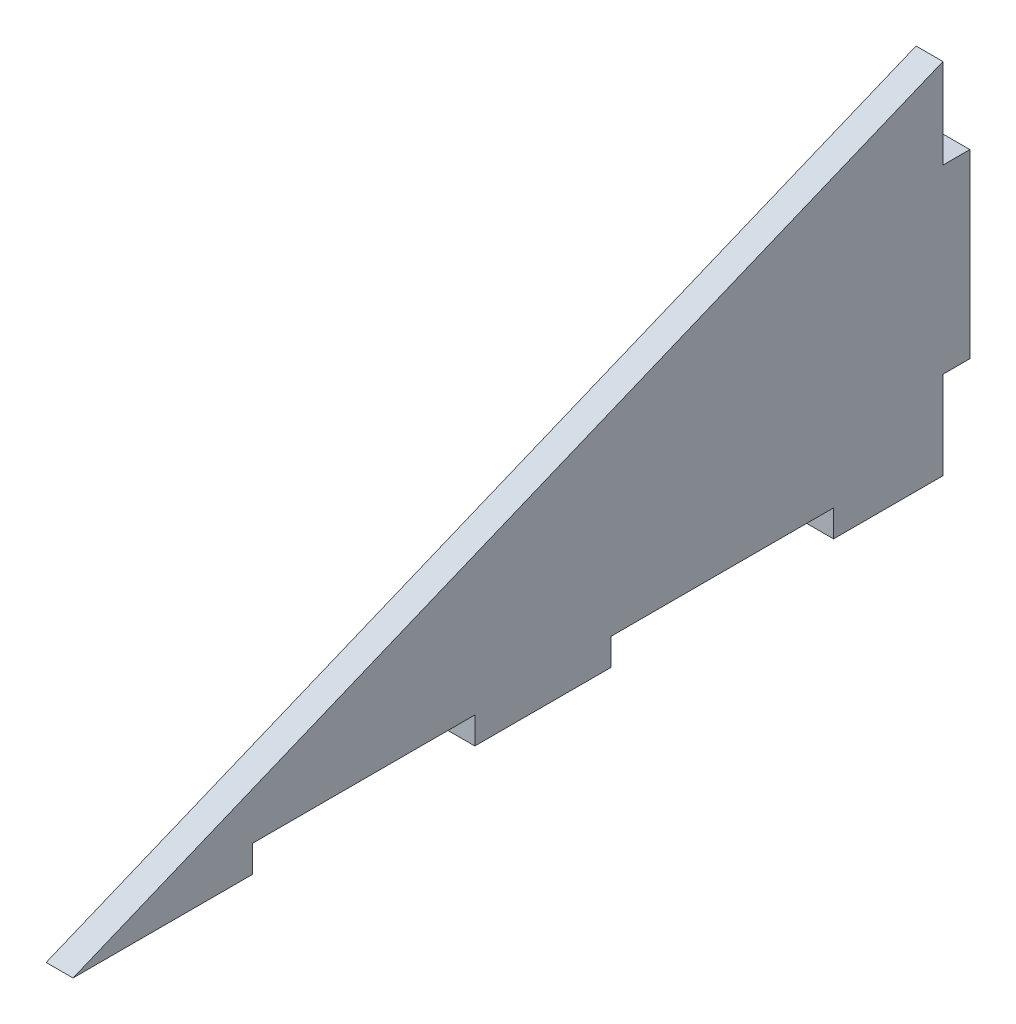
ISO-10303-21;
HEADER;
FILE_DESCRIPTION(('STEP AP214'),'2;1');
FILE_NAME('part.step','',(''),(''),'','','');
FILE_SCHEMA(('AUTOMOTIVE_DESIGN { 1 0 10303 214 1 1 1 1 }'));
ENDSEC;
DATA;
#1=APPLICATION_CONTEXT('core data for automotive mechanical design processes');
#2=APPLICATION_PROTOCOL_DEFINITION('international standard','automotive_design',2000,#1);
#3=PRODUCT_CONTEXT('',#1,'mechanical');
#4=PRODUCT('Part','Part','',(#3));
#5=PRODUCT_RELATED_PRODUCT_CATEGORY('part','',(#4));
#6=PRODUCT_DEFINITION_FORMATION('','',#4);
#7=PRODUCT_DEFINITION_CONTEXT('part definition',#1,'design');
#8=PRODUCT_DEFINITION('design','',#6,#7);
#9=PRODUCT_DEFINITION_SHAPE('','',#8);
#10=(LENGTH_UNIT() NAMED_UNIT(*) SI_UNIT(.MILLI.,.METRE.));
#11=(NAMED_UNIT(*) PLANE_ANGLE_UNIT() SI_UNIT($,.RADIAN.));
#12=(NAMED_UNIT(*) SI_UNIT($,.STERADIAN.) SOLID_ANGLE_UNIT());
#13=UNCERTAINTY_MEASURE_WITH_UNIT(LENGTH_MEASURE(1.E-05),#10,'distance_accuracy_value','');
#14=(GEOMETRIC_REPRESENTATION_CONTEXT(3) GLOBAL_UNCERTAINTY_ASSIGNED_CONTEXT((#13)) GLOBAL_UNIT_ASSIGNED_CONTEXT((#10,
#11,#12)) REPRESENTATION_CONTEXT('',''));
#15=CARTESIAN_POINT('',(0.,0.,0.));
#16=DIRECTION('',(0.,0.,1.));
#17=DIRECTION('',(1.,0.,0.));
#18=AXIS2_PLACEMENT_3D('',#15,#16,#17);
#19=CARTESIAN_POINT('',(3.,0.,40.));
#20=DIRECTION('',(0.,0.,1.));
#21=DIRECTION('',(1.,0.,0.));
#22=AXIS2_PLACEMENT_3D('',#19,#20,#21);
#23=PLANE('',#22);
#24=DIRECTION('',(0.,1.,0.));
#25=VECTOR('',#24,1.);
#26=CARTESIAN_POINT('',(0.,0.,40.));
#27=LINE('',#26,#25);
#28=CARTESIAN_POINT('',(0.,0.,40.));
#29=VERTEX_POINT('',#28);
#30=CARTESIAN_POINT('',(0.,2.99999999999999,40.));
#31=VERTEX_POINT('',#30);
#32=EDGE_CURVE('E178',#29,#31,#27,.T.);
#33=ORIENTED_EDGE('',*,*,#32,.T.);
#34=DIRECTION('',(-1.,0.,0.));
#35=VECTOR('',#34,1.);
#36=CARTESIAN_POINT('',(3.,2.99999999999999,40.));
#37=LINE('',#36,#35);
#38=CARTESIAN_POINT('',(3.,2.99999999999999,40.));
#39=VERTEX_POINT('',#38);
#40=EDGE_CURVE('E11',#39,#31,#37,.T.);
#41=ORIENTED_EDGE('',*,*,#40,.F.);
#42=DIRECTION('',(0.,1.,0.));
#43=VECTOR('',#42,1.);
#44=CARTESIAN_POINT('',(3.,0.,40.));
#45=LINE('',#44,#43);
#46=CARTESIAN_POINT('',(3.,0.,40.));
#47=VERTEX_POINT('',#46);
#48=EDGE_CURVE('E254',#47,#39,#45,.T.);
#49=ORIENTED_EDGE('',*,*,#48,.F.);
#50=DIRECTION('',(-1.,0.,0.));
#51=VECTOR('',#50,1.);
#52=CARTESIAN_POINT('',(3.,0.,40.));
#53=LINE('',#52,#51);
#54=EDGE_CURVE('E52',#47,#29,#53,.T.);
#55=ORIENTED_EDGE('',*,*,#54,.T.);
#56=EDGE_LOOP('',(#33,#41,#49,#55));
#57=FACE_BOUND('',#56,.T.);
#58=ADVANCED_FACE('F36',(#57),#23,.F.);
#59=CARTESIAN_POINT('',(3.,2.99999999999999,0.));
#60=DIRECTION('',(0.,1.,0.));
#61=DIRECTION('',(0.,0.,1.));
#62=AXIS2_PLACEMENT_3D('',#59,#60,#61);
#63=PLANE('',#62);
#64=DIRECTION('',(0.,0.,-1.));
#65=VECTOR('',#64,1.);
#66=CARTESIAN_POINT('',(0.,2.99999999999999,0.));
#67=LINE('',#66,#65);
#68=CARTESIAN_POINT('',(0.,2.99999999999999,15.2));
#69=VERTEX_POINT('',#68);
#70=EDGE_CURVE('E180',#31,#69,#67,.T.);
#71=ORIENTED_EDGE('',*,*,#70,.T.);
#72=DIRECTION('',(-1.,0.,0.));
#73=VECTOR('',#72,1.);
#74=CARTESIAN_POINT('',(3.,2.99999999999999,15.2));
#75=LINE('',#74,#73);
#76=CARTESIAN_POINT('',(3.,2.99999999999999,15.2));
#77=VERTEX_POINT('',#76);
#78=EDGE_CURVE('E44',#77,#69,#75,.T.);
#79=ORIENTED_EDGE('',*,*,#78,.F.);
#80=DIRECTION('',(0.,0.,-1.));
#81=VECTOR('',#80,1.);
#82=CARTESIAN_POINT('',(3.,2.99999999999999,0.));
#83=LINE('',#82,#81);
#84=EDGE_CURVE('E111',#39,#77,#83,.T.);
#85=ORIENTED_EDGE('',*,*,#84,.F.);
#86=ORIENTED_EDGE('',*,*,#40,.T.);
#87=EDGE_LOOP('',(#71,#79,#85,#86));
#88=FACE_BOUND('',#87,.T.);
#89=ADVANCED_FACE('F240',(#88),#63,.F.);
#90=CARTESIAN_POINT('',(3.,0.,15.2));
#91=DIRECTION('',(0.,0.,1.));
#92=DIRECTION('',(1.,0.,0.));
#93=AXIS2_PLACEMENT_3D('',#90,#91,#92);
#94=PLANE('',#93);
#95=DIRECTION('',(0.,1.,0.));
#96=VECTOR('',#95,1.);
#97=CARTESIAN_POINT('',(0.,0.,15.2));
#98=LINE('',#97,#96);
#99=CARTESIAN_POINT('',(0.,0.,15.2));
#100=VERTEX_POINT('',#99);
#101=EDGE_CURVE('E183',#100,#69,#98,.T.);
#102=ORIENTED_EDGE('',*,*,#101,.F.);
#103=DIRECTION('',(-1.,0.,0.));
#104=VECTOR('',#103,1.);
#105=CARTESIAN_POINT('',(3.,0.,15.2));
#106=LINE('',#105,#104);
#107=CARTESIAN_POINT('',(3.,0.,15.2));
#108=VERTEX_POINT('',#107);
#109=EDGE_CURVE('E233',#108,#100,#106,.T.);
#110=ORIENTED_EDGE('',*,*,#109,.F.);
#111=DIRECTION('',(0.,1.,0.));
#112=VECTOR('',#111,1.);
#113=CARTESIAN_POINT('',(3.,0.,15.2));
#114=LINE('',#113,#112);
#115=EDGE_CURVE('E239',#108,#77,#114,.T.);
#116=ORIENTED_EDGE('',*,*,#115,.T.);
#117=ORIENTED_EDGE('',*,*,#78,.T.);
#118=EDGE_LOOP('',(#102,#110,#116,#117));
#119=FACE_BOUND('',#118,.T.);
#120=ADVANCED_FACE('F237',(#119),#94,.T.);
#121=CARTESIAN_POINT('',(3.,0.,0.));
#122=DIRECTION('',(0.,-1.,0.));
#123=DIRECTION('',(0.,0.,-1.));
#124=AXIS2_PLACEMENT_3D('',#121,#122,#123);
#125=PLANE('',#124);
#126=DIRECTION('',(0.,0.,1.));
#127=VECTOR('',#126,1.);
#128=CARTESIAN_POINT('',(0.,0.,0.));
#129=LINE('',#128,#127);
#130=CARTESIAN_POINT('',(0.,0.,3.));
#131=VERTEX_POINT('',#130);
#132=EDGE_CURVE('E186',#131,#100,#129,.T.);
#133=ORIENTED_EDGE('',*,*,#132,.F.);
#134=DIRECTION('',(-1.,0.,0.));
#135=VECTOR('',#134,1.);
#136=CARTESIAN_POINT('',(3.,0.,3.));
#137=LINE('',#136,#135);
#138=CARTESIAN_POINT('',(3.,0.,3.));
#139=VERTEX_POINT('',#138);
#140=EDGE_CURVE('E231',#139,#131,#137,.T.);
#141=ORIENTED_EDGE('',*,*,#140,.F.);
#142=DIRECTION('',(0.,0.,1.));
#143=VECTOR('',#142,1.);
#144=CARTESIAN_POINT('',(3.,0.,0.));
#145=LINE('',#144,#143);
#146=EDGE_CURVE('E175',#139,#108,#145,.T.);
#147=ORIENTED_EDGE('',*,*,#146,.T.);
#148=ORIENTED_EDGE('',*,*,#109,.T.);
#149=EDGE_LOOP('',(#133,#141,#147,#148));
#150=FACE_BOUND('',#149,.T.);
#151=ADVANCED_FACE('F247',(#150),#125,.T.);
#152=CARTESIAN_POINT('',(3.,0.,3.));
#153=DIRECTION('',(0.,0.,-1.));
#154=DIRECTION('',(0.,1.,0.));
#155=AXIS2_PLACEMENT_3D('',#152,#153,#154);
#156=PLANE('',#155);
#157=DIRECTION('',(0.,-1.,0.));
#158=VECTOR('',#157,1.);
#159=CARTESIAN_POINT('',(0.,0.,3.));
#160=LINE('',#159,#158);
#161=CARTESIAN_POINT('',(0.,9.8,3.));
#162=VERTEX_POINT('',#161);
#163=EDGE_CURVE('E189',#162,#131,#160,.T.);
#164=ORIENTED_EDGE('',*,*,#163,.F.);
#165=DIRECTION('',(-1.,0.,0.));
#166=VECTOR('',#165,1.);
#167=CARTESIAN_POINT('',(3.,9.8,3.));
#168=LINE('',#167,#166);
#169=CARTESIAN_POINT('',(3.,9.8,3.));
#170=VERTEX_POINT('',#169);
#171=EDGE_CURVE('E229',#170,#162,#168,.T.);
#172=ORIENTED_EDGE('',*,*,#171,.F.);
#173=DIRECTION('',(0.,-1.,0.));
#174=VECTOR('',#173,1.);
#175=CARTESIAN_POINT('',(3.,0.,3.));
#176=LINE('',#175,#174);
#177=EDGE_CURVE('E253',#170,#139,#176,.T.);
#178=ORIENTED_EDGE('',*,*,#177,.T.);
#179=ORIENTED_EDGE('',*,*,#140,.T.);
#180=EDGE_LOOP('',(#164,#172,#178,#179));
#181=FACE_BOUND('',#180,.T.);
#182=ADVANCED_FACE('F298',(#181),#156,.T.);
#183=CARTESIAN_POINT('',(3.,9.8,0.));
#184=DIRECTION('',(0.,-1.,0.));
#185=DIRECTION('',(0.,0.,-1.));
#186=AXIS2_PLACEMENT_3D('',#183,#184,#185);
#187=PLANE('',#186);
#188=DIRECTION('',(0.,0.,1.));
#189=VECTOR('',#188,1.);
#190=CARTESIAN_POINT('',(0.,9.8,0.));
#191=LINE('',#190,#189);
#192=CARTESIAN_POINT('',(0.,9.8,0.));
#193=VERTEX_POINT('',#192);
#194=EDGE_CURVE('E194',#193,#162,#191,.T.);
#195=ORIENTED_EDGE('',*,*,#194,.F.);
#196=DIRECTION('',(-1.,0.,0.));
#197=VECTOR('',#196,1.);
#198=CARTESIAN_POINT('',(3.,9.8,0.));
#199=LINE('',#198,#197);
#200=CARTESIAN_POINT('',(3.,9.8,0.));
#201=VERTEX_POINT('',#200);
#202=EDGE_CURVE('E227',#201,#193,#199,.T.);
#203=ORIENTED_EDGE('',*,*,#202,.F.);
#204=DIRECTION('',(0.,0.,1.));
#205=VECTOR('',#204,1.);
#206=CARTESIAN_POINT('',(3.,9.8,0.));
#207=LINE('',#206,#205);
#208=EDGE_CURVE('E259',#201,#170,#207,.T.);
#209=ORIENTED_EDGE('',*,*,#208,.T.);
#210=ORIENTED_EDGE('',*,*,#171,.T.);
#211=EDGE_LOOP('',(#195,#203,#209,#210));
#212=FACE_BOUND('',#211,.T.);
#213=ADVANCED_FACE('F312',(#212),#187,.T.);
#214=CARTESIAN_POINT('',(3.,0.,0.));
#215=DIRECTION('',(0.,0.,-1.));
#216=DIRECTION('',(-1.,0.,0.));
#217=AXIS2_PLACEMENT_3D('',#214,#215,#216);
#218=PLANE('',#217);
#219=DIRECTION('',(0.,-1.,0.));
#220=VECTOR('',#219,1.);
#221=CARTESIAN_POINT('',(0.,0.,0.));
#222=LINE('',#221,#220);
#223=CARTESIAN_POINT('',(0.,30.,0.));
#224=VERTEX_POINT('',#223);
#225=EDGE_CURVE('E197',#224,#193,#222,.T.);
#226=ORIENTED_EDGE('',*,*,#225,.F.);
#227=DIRECTION('',(-1.,0.,0.));
#228=VECTOR('',#227,1.);
#229=CARTESIAN_POINT('',(3.,30.,0.));
#230=LINE('',#229,#228);
#231=CARTESIAN_POINT('',(3.,30.,0.));
#232=VERTEX_POINT('',#231);
#233=EDGE_CURVE('E225',#232,#224,#230,.T.);
#234=ORIENTED_EDGE('',*,*,#233,.F.);
#235=DIRECTION('',(0.,-1.,0.));
#236=VECTOR('',#235,1.);
#237=CARTESIAN_POINT('',(3.,0.,0.));
#238=LINE('',#237,#236);
#239=EDGE_CURVE('E262',#232,#201,#238,.T.);
#240=ORIENTED_EDGE('',*,*,#239,.T.);
#241=ORIENTED_EDGE('',*,*,#202,.T.);
#242=EDGE_LOOP('',(#226,#234,#240,#241));
#243=FACE_BOUND('',#242,.T.);
#244=ADVANCED_FACE('F316',(#243),#218,.T.);
#245=CARTESIAN_POINT('',(3.,30.,0.));
#246=DIRECTION('',(0.,1.,0.));
#247=DIRECTION('',(0.,0.,1.));
#248=AXIS2_PLACEMENT_3D('',#245,#246,#247);
#249=PLANE('',#248);
#250=DIRECTION('',(0.,0.,-1.));
#251=VECTOR('',#250,1.);
#252=CARTESIAN_POINT('',(0.,30.,0.));
#253=LINE('',#252,#251);
#254=CARTESIAN_POINT('',(0.,30.,2.99999999999998));
#255=VERTEX_POINT('',#254);
#256=EDGE_CURVE('E200',#255,#224,#253,.T.);
#257=ORIENTED_EDGE('',*,*,#256,.F.);
#258=DIRECTION('',(-1.,0.,0.));
#259=VECTOR('',#258,1.);
#260=CARTESIAN_POINT('',(3.,30.,2.99999999999998));
#261=LINE('',#260,#259);
#262=CARTESIAN_POINT('',(3.,30.,2.99999999999998));
#263=VERTEX_POINT('',#262);
#264=EDGE_CURVE('E223',#263,#255,#261,.T.);
#265=ORIENTED_EDGE('',*,*,#264,.F.);
#266=DIRECTION('',(0.,0.,-1.));
#267=VECTOR('',#266,1.);
#268=CARTESIAN_POINT('',(3.,30.,0.));
#269=LINE('',#268,#267);
#270=EDGE_CURVE('E265',#263,#232,#269,.T.);
#271=ORIENTED_EDGE('',*,*,#270,.T.);
#272=ORIENTED_EDGE('',*,*,#233,.T.);
#273=EDGE_LOOP('',(#257,#265,#271,#272));
#274=FACE_BOUND('',#273,.T.);
#275=ADVANCED_FACE('F320',(#274),#249,.T.);
#276=CARTESIAN_POINT('',(3.,0.,2.99999999999997));
#277=DIRECTION('',(0.,0.,-1.));
#278=DIRECTION('',(0.,1.,0.));
#279=AXIS2_PLACEMENT_3D('',#276,#277,#278);
#280=PLANE('',#279);
#281=DIRECTION('',(0.,-1.,0.));
#282=VECTOR('',#281,1.);
#283=CARTESIAN_POINT('',(0.,0.,2.99999999999997));
#284=LINE('',#283,#282);
#285=CARTESIAN_POINT('',(0.,40.,2.99999999999998));
#286=VERTEX_POINT('',#285);
#287=EDGE_CURVE('E203',#286,#255,#284,.T.);
#288=ORIENTED_EDGE('',*,*,#287,.F.);
#289=DIRECTION('',(-1.,0.,0.));
#290=VECTOR('',#289,1.);
#291=CARTESIAN_POINT('',(3.,40.,2.99999999999998));
#292=LINE('',#291,#290);
#293=CARTESIAN_POINT('',(3.,40.,2.99999999999998));
#294=VERTEX_POINT('',#293);
#295=EDGE_CURVE('E221',#294,#286,#292,.T.);
#296=ORIENTED_EDGE('',*,*,#295,.F.);
#297=DIRECTION('',(0.,-1.,0.));
#298=VECTOR('',#297,1.);
#299=CARTESIAN_POINT('',(3.,0.,2.99999999999997));
#300=LINE('',#299,#298);
#301=EDGE_CURVE('E268',#294,#263,#300,.T.);
#302=ORIENTED_EDGE('',*,*,#301,.T.);
#303=ORIENTED_EDGE('',*,*,#264,.T.);
#304=EDGE_LOOP('',(#288,#296,#302,#303));
#305=FACE_BOUND('',#304,.T.);
#306=ADVANCED_FACE('F324',(#305),#280,.T.);
#307=CARTESIAN_POINT('',(3.,35.2438913616132,14.5335634480879));
#308=DIRECTION('',(0.,0.924480592289054,0.38122911022229));
#309=DIRECTION('',(0.,-0.38122911022229,0.924480592289055));
#310=AXIS2_PLACEMENT_3D('',#307,#308,#309);
#311=PLANE('',#310);
#312=DIRECTION('',(0.,0.38122911022229,-0.924480592289055));
#313=VECTOR('',#312,1.);
#314=CARTESIAN_POINT('',(0.,35.2438913616132,14.5335634480879));
#315=LINE('',#314,#313);
#316=CARTESIAN_POINT('',(0.,0.,100.));
#317=VERTEX_POINT('',#316);
#318=EDGE_CURVE('E206',#317,#286,#315,.T.);
#319=ORIENTED_EDGE('',*,*,#318,.F.);
#320=DIRECTION('',(-1.,0.,0.));
#321=VECTOR('',#320,1.);
#322=CARTESIAN_POINT('',(3.,0.,100.));
#323=LINE('',#322,#321);
#324=CARTESIAN_POINT('',(3.,0.,100.));
#325=VERTEX_POINT('',#324);
#326=EDGE_CURVE('E219',#325,#317,#323,.T.);
#327=ORIENTED_EDGE('',*,*,#326,.F.);
#328=DIRECTION('',(0.,0.38122911022229,-0.924480592289055));
#329=VECTOR('',#328,1.);
#330=CARTESIAN_POINT('',(3.,35.2438913616132,14.5335634480879));
#331=LINE('',#330,#329);
#332=EDGE_CURVE('E271',#325,#294,#331,.T.);
#333=ORIENTED_EDGE('',*,*,#332,.T.);
#334=ORIENTED_EDGE('',*,*,#295,.T.);
#335=EDGE_LOOP('',(#319,#327,#333,#334));
#336=FACE_BOUND('',#335,.T.);
#337=ADVANCED_FACE('F282',(#336),#311,.T.);
#338=CARTESIAN_POINT('',(0.,0.,80.));
#339=VERTEX_POINT('',#338);
#340=EDGE_CURVE('E191',#339,#317,#129,.T.);
#341=ORIENTED_EDGE('',*,*,#340,.F.);
#342=DIRECTION('',(-1.,0.,0.));
#343=VECTOR('',#342,1.);
#344=CARTESIAN_POINT('',(3.,0.,80.));
#345=LINE('',#344,#343);
#346=CARTESIAN_POINT('',(3.,0.,80.));
#347=VERTEX_POINT('',#346);
#348=EDGE_CURVE('E217',#347,#339,#345,.T.);
#349=ORIENTED_EDGE('',*,*,#348,.F.);
#350=EDGE_CURVE('E174',#347,#325,#145,.T.);
#351=ORIENTED_EDGE('',*,*,#350,.T.);
#352=ORIENTED_EDGE('',*,*,#326,.T.);
#353=EDGE_LOOP('',(#341,#349,#351,#352));
#354=FACE_BOUND('',#353,.T.);
#355=ADVANCED_FACE('F276',(#354),#125,.T.);
#356=CARTESIAN_POINT('',(3.,0.,80.));
#357=DIRECTION('',(0.,0.,1.));
#358=DIRECTION('',(1.,0.,0.));
#359=AXIS2_PLACEMENT_3D('',#356,#357,#358);
#360=PLANE('',#359);
#361=DIRECTION('',(0.,1.,0.));
#362=VECTOR('',#361,1.);
#363=CARTESIAN_POINT('',(0.,0.,80.));
#364=LINE('',#363,#362);
#365=CARTESIAN_POINT('',(0.,2.99999999999999,80.));
#366=VERTEX_POINT('',#365);
#367=EDGE_CURVE('E209',#339,#366,#364,.T.);
#368=ORIENTED_EDGE('',*,*,#367,.T.);
#369=DIRECTION('',(-1.,0.,0.));
#370=VECTOR('',#369,1.);
#371=CARTESIAN_POINT('',(3.,2.99999999999999,80.));
#372=LINE('',#371,#370);
#373=CARTESIAN_POINT('',(3.,2.99999999999999,80.));
#374=VERTEX_POINT('',#373);
#375=EDGE_CURVE('E168',#374,#366,#372,.T.);
#376=ORIENTED_EDGE('',*,*,#375,.F.);
#377=DIRECTION('',(0.,1.,0.));
#378=VECTOR('',#377,1.);
#379=CARTESIAN_POINT('',(3.,0.,80.));
#380=LINE('',#379,#378);
#381=EDGE_CURVE('E156',#347,#374,#380,.T.);
#382=ORIENTED_EDGE('',*,*,#381,.F.);
#383=ORIENTED_EDGE('',*,*,#348,.T.);
#384=EDGE_LOOP('',(#368,#376,#382,#383));
#385=FACE_BOUND('',#384,.T.);
#386=ADVANCED_FACE('F300',(#385),#360,.F.);
#387=CARTESIAN_POINT('',(3.,2.99999999999999,0.));
#388=DIRECTION('',(0.,1.,0.));
#389=DIRECTION('',(0.,0.,1.));
#390=AXIS2_PLACEMENT_3D('',#387,#388,#389);
#391=PLANE('',#390);
#392=DIRECTION('',(0.,0.,-1.));
#393=VECTOR('',#392,1.);
#394=CARTESIAN_POINT('',(0.,2.99999999999999,0.));
#395=LINE('',#394,#393);
#396=CARTESIAN_POINT('',(0.,2.99999999999999,55.2));
#397=VERTEX_POINT('',#396);
#398=EDGE_CURVE('E165',#366,#397,#395,.T.);
#399=ORIENTED_EDGE('',*,*,#398,.T.);
#400=DIRECTION('',(-1.,0.,0.));
#401=VECTOR('',#400,1.);
#402=CARTESIAN_POINT('',(3.,2.99999999999999,55.2));
#403=LINE('',#402,#401);
#404=CARTESIAN_POINT('',(3.,2.99999999999999,55.2));
#405=VERTEX_POINT('',#404);
#406=EDGE_CURVE('E162',#405,#397,#403,.T.);
#407=ORIENTED_EDGE('',*,*,#406,.F.);
#408=DIRECTION('',(0.,0.,-1.));
#409=VECTOR('',#408,1.);
#410=CARTESIAN_POINT('',(3.,2.99999999999999,0.));
#411=LINE('',#410,#409);
#412=EDGE_CURVE('E148',#374,#405,#411,.T.);
#413=ORIENTED_EDGE('',*,*,#412,.F.);
#414=ORIENTED_EDGE('',*,*,#375,.T.);
#415=EDGE_LOOP('',(#399,#407,#413,#414));
#416=FACE_BOUND('',#415,.T.);
#417=ADVANCED_FACE('F163',(#416),#391,.F.);
#418=CARTESIAN_POINT('',(3.,0.,55.2));
#419=DIRECTION('',(0.,0.,1.));
#420=DIRECTION('',(1.,0.,0.));
#421=AXIS2_PLACEMENT_3D('',#418,#419,#420);
#422=PLANE('',#421);
#423=DIRECTION('',(0.,1.,0.));
#424=VECTOR('',#423,1.);
#425=CARTESIAN_POINT('',(0.,0.,55.2));
#426=LINE('',#425,#424);
#427=CARTESIAN_POINT('',(0.,0.,55.2));
#428=VERTEX_POINT('',#427);
#429=EDGE_CURVE('E212',#428,#397,#426,.T.);
#430=ORIENTED_EDGE('',*,*,#429,.F.);
#431=DIRECTION('',(-1.,0.,0.));
#432=VECTOR('',#431,1.);
#433=CARTESIAN_POINT('',(3.,0.,55.2));
#434=LINE('',#433,#432);
#435=CARTESIAN_POINT('',(3.,0.,55.2));
#436=VERTEX_POINT('',#435);
#437=EDGE_CURVE('E99',#436,#428,#434,.T.);
#438=ORIENTED_EDGE('',*,*,#437,.F.);
#439=DIRECTION('',(0.,1.,0.));
#440=VECTOR('',#439,1.);
#441=CARTESIAN_POINT('',(3.,0.,55.2));
#442=LINE('',#441,#440);
#443=EDGE_CURVE('E153',#436,#405,#442,.T.);
#444=ORIENTED_EDGE('',*,*,#443,.T.);
#445=ORIENTED_EDGE('',*,*,#406,.T.);
#446=EDGE_LOOP('',(#430,#438,#444,#445));
#447=FACE_BOUND('',#446,.T.);
#448=ADVANCED_FACE('F170',(#447),#422,.T.);
#449=EDGE_CURVE('E190',#29,#428,#129,.T.);
#450=ORIENTED_EDGE('',*,*,#449,.F.);
#451=ORIENTED_EDGE('',*,*,#54,.F.);
#452=EDGE_CURVE('E171',#47,#436,#145,.T.);
#453=ORIENTED_EDGE('',*,*,#452,.T.);
#454=ORIENTED_EDGE('',*,*,#437,.T.);
#455=EDGE_LOOP('',(#450,#451,#453,#454));
#456=FACE_BOUND('',#455,.T.);
#457=ADVANCED_FACE('F287',(#456),#125,.T.);
#458=CARTESIAN_POINT('',(3.,0.,0.));
#459=DIRECTION('',(1.,0.,0.));
#460=DIRECTION('',(0.,0.,-1.));
#461=AXIS2_PLACEMENT_3D('',#458,#459,#460);
#462=PLANE('',#461);
#463=ORIENTED_EDGE('',*,*,#48,.T.);
#464=ORIENTED_EDGE('',*,*,#84,.T.);
#465=ORIENTED_EDGE('',*,*,#115,.F.);
#466=ORIENTED_EDGE('',*,*,#146,.F.);
#467=ORIENTED_EDGE('',*,*,#177,.F.);
#468=ORIENTED_EDGE('',*,*,#208,.F.);
#469=ORIENTED_EDGE('',*,*,#239,.F.);
#470=ORIENTED_EDGE('',*,*,#270,.F.);
#471=ORIENTED_EDGE('',*,*,#301,.F.);
#472=ORIENTED_EDGE('',*,*,#332,.F.);
#473=ORIENTED_EDGE('',*,*,#350,.F.);
#474=ORIENTED_EDGE('',*,*,#381,.T.);
#475=ORIENTED_EDGE('',*,*,#412,.T.);
#476=ORIENTED_EDGE('',*,*,#443,.F.);
#477=ORIENTED_EDGE('',*,*,#452,.F.);
#478=EDGE_LOOP('',(#463,#464,#465,#466,#467,#468,#469,#470,#471,#472,#473,#474,#475,#476,#477));
#479=FACE_BOUND('',#478,.T.);
#480=ADVANCED_FACE('F150',(#479),#462,.T.);
#481=CARTESIAN_POINT('',(0.,0.,0.));
#482=DIRECTION('',(1.,0.,0.));
#483=DIRECTION('',(0.,0.,-1.));
#484=AXIS2_PLACEMENT_3D('',#481,#482,#483);
#485=PLANE('',#484);
#486=ORIENTED_EDGE('',*,*,#32,.F.);
#487=ORIENTED_EDGE('',*,*,#449,.T.);
#488=ORIENTED_EDGE('',*,*,#429,.T.);
#489=ORIENTED_EDGE('',*,*,#398,.F.);
#490=ORIENTED_EDGE('',*,*,#367,.F.);
#491=ORIENTED_EDGE('',*,*,#340,.T.);
#492=ORIENTED_EDGE('',*,*,#318,.T.);
#493=ORIENTED_EDGE('',*,*,#287,.T.);
#494=ORIENTED_EDGE('',*,*,#256,.T.);
#495=ORIENTED_EDGE('',*,*,#225,.T.);
#496=ORIENTED_EDGE('',*,*,#194,.T.);
#497=ORIENTED_EDGE('',*,*,#163,.T.);
#498=ORIENTED_EDGE('',*,*,#132,.T.);
#499=ORIENTED_EDGE('',*,*,#101,.T.);
#500=ORIENTED_EDGE('',*,*,#70,.F.);
#501=EDGE_LOOP('',(#486,#487,#488,#489,#490,#491,#492,#493,#494,#495,#496,#497,#498,#499,#500));
#502=FACE_BOUND('',#501,.T.);
#503=ADVANCED_FACE('F243',(#502),#485,.F.);
#504=CLOSED_SHELL('',(#58,#89,#120,#151,#182,#213,#244,#275,#306,#337,#355,#386,#417,#448,#457,
#480,#503));
#505=MANIFOLD_SOLID_BREP('B2',#504);
#506=ADVANCED_BREP_SHAPE_REPRESENTATION('',(#18,#505),#14);
#507=SHAPE_DEFINITION_REPRESENTATION(#9,#506);
ENDSEC;
END-ISO-10303-21;
